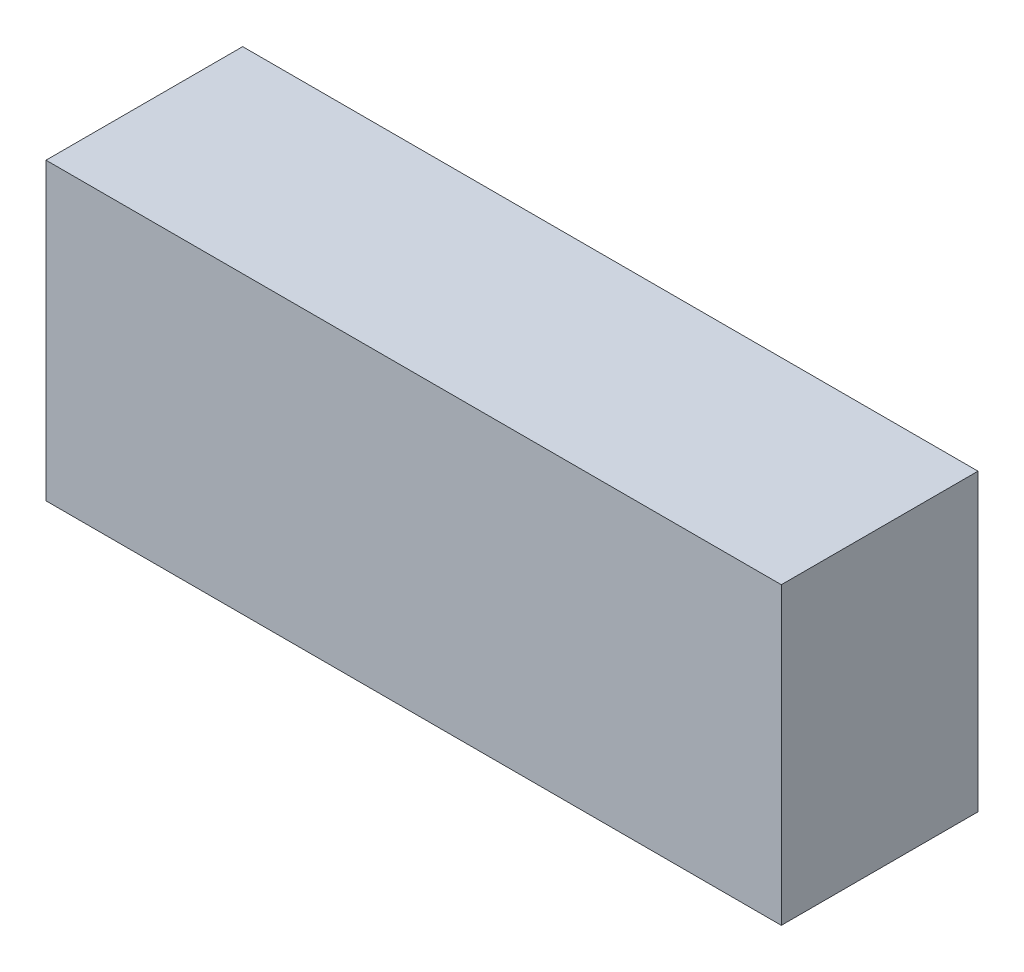
ISO-10303-21;
HEADER;
FILE_DESCRIPTION(('STEP AP214'),'2;1');
FILE_NAME('part.step','',(''),(''),'','','');
FILE_SCHEMA(('AUTOMOTIVE_DESIGN { 1 0 10303 214 1 1 1 1 }'));
ENDSEC;
DATA;
#1=APPLICATION_CONTEXT('core data for automotive mechanical design processes');
#2=APPLICATION_PROTOCOL_DEFINITION('international standard','automotive_design',2000,#1);
#3=PRODUCT_CONTEXT('',#1,'mechanical');
#4=PRODUCT('Part','Part','',(#3));
#5=PRODUCT_RELATED_PRODUCT_CATEGORY('part','',(#4));
#6=PRODUCT_DEFINITION_FORMATION('','',#4);
#7=PRODUCT_DEFINITION_CONTEXT('part definition',#1,'design');
#8=PRODUCT_DEFINITION('design','',#6,#7);
#9=PRODUCT_DEFINITION_SHAPE('','',#8);
#10=(LENGTH_UNIT() NAMED_UNIT(*) SI_UNIT(.MILLI.,.METRE.));
#11=(NAMED_UNIT(*) PLANE_ANGLE_UNIT() SI_UNIT($,.RADIAN.));
#12=(NAMED_UNIT(*) SI_UNIT($,.STERADIAN.) SOLID_ANGLE_UNIT());
#13=UNCERTAINTY_MEASURE_WITH_UNIT(LENGTH_MEASURE(1.E-05),#10,'distance_accuracy_value','');
#14=(GEOMETRIC_REPRESENTATION_CONTEXT(3) GLOBAL_UNCERTAINTY_ASSIGNED_CONTEXT((#13)) GLOBAL_UNIT_ASSIGNED_CONTEXT((#10,
#11,#12)) REPRESENTATION_CONTEXT('',''));
#15=CARTESIAN_POINT('',(0.,0.,0.));
#16=DIRECTION('',(0.,0.,1.));
#17=DIRECTION('',(1.,0.,0.));
#18=AXIS2_PLACEMENT_3D('',#15,#16,#17);
#19=CARTESIAN_POINT('',(-18.6928519593613,-7.5,10.));
#20=DIRECTION('',(1.,0.,0.));
#21=DIRECTION('',(0.,0.,-1.));
#22=AXIS2_PLACEMENT_3D('',#19,#20,#21);
#23=PLANE('',#22);
#24=DIRECTION('',(0.,-1.,0.));
#25=VECTOR('',#24,1.);
#26=CARTESIAN_POINT('',(-18.6928519593613,-7.5,0.));
#27=LINE('',#26,#25);
#28=CARTESIAN_POINT('',(-18.6928519593613,7.5,0.));
#29=VERTEX_POINT('',#28);
#30=CARTESIAN_POINT('',(-18.6928519593613,-7.5,0.));
#31=VERTEX_POINT('',#30);
#32=EDGE_CURVE('E98',#29,#31,#27,.T.);
#33=ORIENTED_EDGE('',*,*,#32,.T.);
#34=DIRECTION('',(0.,0.,-1.));
#35=VECTOR('',#34,1.);
#36=CARTESIAN_POINT('',(-18.6928519593613,-7.5,10.));
#37=LINE('',#36,#35);
#38=CARTESIAN_POINT('',(-18.6928519593613,-7.5,10.));
#39=VERTEX_POINT('',#38);
#40=EDGE_CURVE('E11',#39,#31,#37,.T.);
#41=ORIENTED_EDGE('',*,*,#40,.F.);
#42=DIRECTION('',(0.,-1.,0.));
#43=VECTOR('',#42,1.);
#44=CARTESIAN_POINT('',(-18.6928519593613,-7.5,10.));
#45=LINE('',#44,#43);
#46=CARTESIAN_POINT('',(-18.6928519593613,7.5,10.));
#47=VERTEX_POINT('',#46);
#48=EDGE_CURVE('E86',#47,#39,#45,.T.);
#49=ORIENTED_EDGE('',*,*,#48,.F.);
#50=DIRECTION('',(0.,0.,-1.));
#51=VECTOR('',#50,1.);
#52=CARTESIAN_POINT('',(-18.6928519593613,7.5,10.));
#53=LINE('',#52,#51);
#54=EDGE_CURVE('E94',#47,#29,#53,.T.);
#55=ORIENTED_EDGE('',*,*,#54,.T.);
#56=EDGE_LOOP('',(#33,#41,#49,#55));
#57=FACE_BOUND('',#56,.T.);
#58=ADVANCED_FACE('F35',(#57),#23,.F.);
#59=CARTESIAN_POINT('',(18.6928519593613,-7.5,10.));
#60=DIRECTION('',(0.,1.,0.));
#61=DIRECTION('',(0.,0.,1.));
#62=AXIS2_PLACEMENT_3D('',#59,#60,#61);
#63=PLANE('',#62);
#64=DIRECTION('',(1.,0.,0.));
#65=VECTOR('',#64,1.);
#66=CARTESIAN_POINT('',(18.6928519593613,-7.5,0.));
#67=LINE('',#66,#65);
#68=CARTESIAN_POINT('',(18.6928519593613,-7.5,0.));
#69=VERTEX_POINT('',#68);
#70=EDGE_CURVE('E90',#31,#69,#67,.T.);
#71=ORIENTED_EDGE('',*,*,#70,.T.);
#72=DIRECTION('',(0.,0.,-1.));
#73=VECTOR('',#72,1.);
#74=CARTESIAN_POINT('',(18.6928519593613,-7.5,10.));
#75=LINE('',#74,#73);
#76=CARTESIAN_POINT('',(18.6928519593613,-7.5,10.));
#77=VERTEX_POINT('',#76);
#78=EDGE_CURVE('E43',#77,#69,#75,.T.);
#79=ORIENTED_EDGE('',*,*,#78,.F.);
#80=DIRECTION('',(1.,0.,0.));
#81=VECTOR('',#80,1.);
#82=CARTESIAN_POINT('',(18.6928519593613,-7.5,10.));
#83=LINE('',#82,#81);
#84=EDGE_CURVE('E81',#39,#77,#83,.T.);
#85=ORIENTED_EDGE('',*,*,#84,.F.);
#86=ORIENTED_EDGE('',*,*,#40,.T.);
#87=EDGE_LOOP('',(#71,#79,#85,#86));
#88=FACE_BOUND('',#87,.T.);
#89=ADVANCED_FACE('F89',(#88),#63,.F.);
#90=CARTESIAN_POINT('',(18.6928519593613,-7.5,10.));
#91=DIRECTION('',(-1.,0.,0.));
#92=DIRECTION('',(0.,0.,1.));
#93=AXIS2_PLACEMENT_3D('',#90,#91,#92);
#94=PLANE('',#93);
#95=DIRECTION('',(0.,1.,0.));
#96=VECTOR('',#95,1.);
#97=CARTESIAN_POINT('',(18.6928519593613,-7.5,0.));
#98=LINE('',#97,#96);
#99=CARTESIAN_POINT('',(18.6928519593613,7.5,0.));
#100=VERTEX_POINT('',#99);
#101=EDGE_CURVE('E68',#69,#100,#98,.T.);
#102=ORIENTED_EDGE('',*,*,#101,.T.);
#103=DIRECTION('',(0.,0.,-1.));
#104=VECTOR('',#103,1.);
#105=CARTESIAN_POINT('',(18.6928519593613,7.5,10.));
#106=LINE('',#105,#104);
#107=CARTESIAN_POINT('',(18.6928519593613,7.5,10.));
#108=VERTEX_POINT('',#107);
#109=EDGE_CURVE('E91',#108,#100,#106,.T.);
#110=ORIENTED_EDGE('',*,*,#109,.F.);
#111=DIRECTION('',(0.,1.,0.));
#112=VECTOR('',#111,1.);
#113=CARTESIAN_POINT('',(18.6928519593613,-7.5,10.));
#114=LINE('',#113,#112);
#115=EDGE_CURVE('E84',#77,#108,#114,.T.);
#116=ORIENTED_EDGE('',*,*,#115,.F.);
#117=ORIENTED_EDGE('',*,*,#78,.T.);
#118=EDGE_LOOP('',(#102,#110,#116,#117));
#119=FACE_BOUND('',#118,.T.);
#120=ADVANCED_FACE('F92',(#119),#94,.F.);
#121=CARTESIAN_POINT('',(18.6928519593613,7.5,10.));
#122=DIRECTION('',(0.,-1.,0.));
#123=DIRECTION('',(0.,0.,-1.));
#124=AXIS2_PLACEMENT_3D('',#121,#122,#123);
#125=PLANE('',#124);
#126=DIRECTION('',(-1.,0.,0.));
#127=VECTOR('',#126,1.);
#128=CARTESIAN_POINT('',(18.6928519593613,7.5,0.));
#129=LINE('',#128,#127);
#130=EDGE_CURVE('E74',#100,#29,#129,.T.);
#131=ORIENTED_EDGE('',*,*,#130,.T.);
#132=ORIENTED_EDGE('',*,*,#54,.F.);
#133=DIRECTION('',(-1.,0.,0.));
#134=VECTOR('',#133,1.);
#135=CARTESIAN_POINT('',(18.6928519593613,7.5,10.));
#136=LINE('',#135,#134);
#137=EDGE_CURVE('E51',#108,#47,#136,.T.);
#138=ORIENTED_EDGE('',*,*,#137,.F.);
#139=ORIENTED_EDGE('',*,*,#109,.T.);
#140=EDGE_LOOP('',(#131,#132,#138,#139));
#141=FACE_BOUND('',#140,.T.);
#142=ADVANCED_FACE('F105',(#141),#125,.F.);
#143=CARTESIAN_POINT('',(0.,0.,10.));
#144=DIRECTION('',(0.,0.,1.));
#145=DIRECTION('',(1.,0.,0.));
#146=AXIS2_PLACEMENT_3D('',#143,#144,#145);
#147=PLANE('',#146);
#148=ORIENTED_EDGE('',*,*,#48,.T.);
#149=ORIENTED_EDGE('',*,*,#84,.T.);
#150=ORIENTED_EDGE('',*,*,#115,.T.);
#151=ORIENTED_EDGE('',*,*,#137,.T.);
#152=EDGE_LOOP('',(#148,#149,#150,#151));
#153=FACE_BOUND('',#152,.T.);
#154=ADVANCED_FACE('F82',(#153),#147,.T.);
#155=CARTESIAN_POINT('',(0.,0.,0.));
#156=DIRECTION('',(0.,0.,1.));
#157=DIRECTION('',(1.,0.,0.));
#158=AXIS2_PLACEMENT_3D('',#155,#156,#157);
#159=PLANE('',#158);
#160=ORIENTED_EDGE('',*,*,#32,.F.);
#161=ORIENTED_EDGE('',*,*,#130,.F.);
#162=ORIENTED_EDGE('',*,*,#101,.F.);
#163=ORIENTED_EDGE('',*,*,#70,.F.);
#164=EDGE_LOOP('',(#160,#161,#162,#163));
#165=FACE_BOUND('',#164,.T.);
#166=ADVANCED_FACE('F108',(#165),#159,.F.);
#167=CLOSED_SHELL('',(#58,#89,#120,#142,#154,#166));
#168=MANIFOLD_SOLID_BREP('B2',#167);
#169=ADVANCED_BREP_SHAPE_REPRESENTATION('',(#18,#168),#14);
#170=SHAPE_DEFINITION_REPRESENTATION(#9,#169);
ENDSEC;
END-ISO-10303-21;
